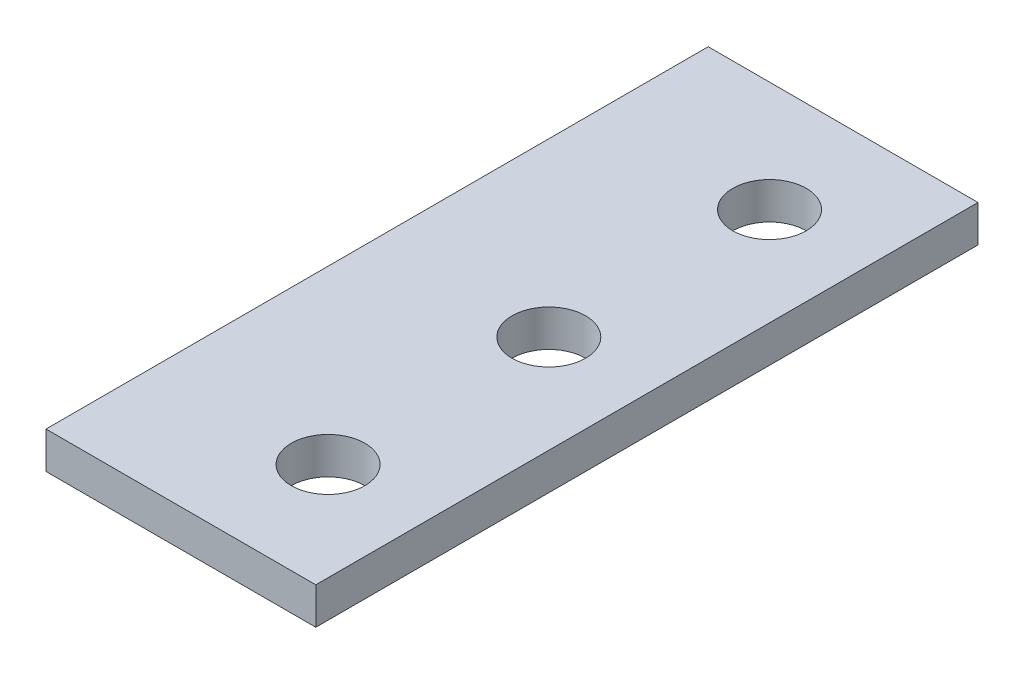
ISO-10303-21;
HEADER;
FILE_DESCRIPTION(('STEP AP214'),'2;1');
FILE_NAME('part.step','',(''),(''),'','','');
FILE_SCHEMA(('AUTOMOTIVE_DESIGN { 1 0 10303 214 1 1 1 1 }'));
ENDSEC;
DATA;
#1=APPLICATION_CONTEXT('core data for automotive mechanical design processes');
#2=APPLICATION_PROTOCOL_DEFINITION('international standard','automotive_design',2000,#1);
#3=PRODUCT_CONTEXT('',#1,'mechanical');
#4=PRODUCT('Part','Part','',(#3));
#5=PRODUCT_RELATED_PRODUCT_CATEGORY('part','',(#4));
#6=PRODUCT_DEFINITION_FORMATION('','',#4);
#7=PRODUCT_DEFINITION_CONTEXT('part definition',#1,'design');
#8=PRODUCT_DEFINITION('design','',#6,#7);
#9=PRODUCT_DEFINITION_SHAPE('','',#8);
#10=(LENGTH_UNIT() NAMED_UNIT(*) SI_UNIT(.MILLI.,.METRE.));
#11=(NAMED_UNIT(*) PLANE_ANGLE_UNIT() SI_UNIT($,.RADIAN.));
#12=(NAMED_UNIT(*) SI_UNIT($,.STERADIAN.) SOLID_ANGLE_UNIT());
#13=UNCERTAINTY_MEASURE_WITH_UNIT(LENGTH_MEASURE(1.E-05),#10,'distance_accuracy_value','');
#14=(GEOMETRIC_REPRESENTATION_CONTEXT(3) GLOBAL_UNCERTAINTY_ASSIGNED_CONTEXT((#13)) GLOBAL_UNIT_ASSIGNED_CONTEXT((#10,
#11,#12)) REPRESENTATION_CONTEXT('',''));
#15=CARTESIAN_POINT('',(0.,0.,0.));
#16=DIRECTION('',(0.,0.,1.));
#17=DIRECTION('',(1.,0.,0.));
#18=AXIS2_PLACEMENT_3D('',#15,#16,#17);
#19=CARTESIAN_POINT('',(0.,9.,0.));
#20=DIRECTION('',(0.,1.,0.));
#21=DIRECTION('',(0.,0.,1.));
#22=AXIS2_PLACEMENT_3D('',#19,#20,#21);
#23=PLANE('',#22);
#24=CARTESIAN_POINT('',(10.4821420896549,9.,-16.5566037735849));
#25=DIRECTION('',(0.,1.,0.));
#26=DIRECTION('',(0.,0.,1.));
#27=AXIS2_PLACEMENT_3D('',#24,#25,#26);
#28=CIRCLE('',#27,9.);
#29=CARTESIAN_POINT('',(10.4821420896549,9.,-7.55660377358494));
#30=VERTEX_POINT('',#29);
#31=EDGE_CURVE('E140',#30,#30,#28,.T.);
#32=ORIENTED_EDGE('',*,*,#31,.F.);
#33=EDGE_LOOP('',(#32));
#34=FACE_BOUND('',#33,.T.);
#35=DIRECTION('',(0.,0.,1.));
#36=VECTOR('',#35,1.);
#37=CARTESIAN_POINT('',(-31.5178579103451,9.,-97.556603773585));
#38=LINE('',#37,#36);
#39=CARTESIAN_POINT('',(-31.5178579103451,9.,-97.556603773585));
#40=VERTEX_POINT('',#39);
#41=CARTESIAN_POINT('',(-31.5178579103451,9.,64.443396226415));
#42=VERTEX_POINT('',#41);
#43=EDGE_CURVE('E97',#40,#42,#38,.T.);
#44=ORIENTED_EDGE('',*,*,#43,.T.);
#45=DIRECTION('',(1.,0.,0.));
#46=VECTOR('',#45,1.);
#47=CARTESIAN_POINT('',(-31.5178579103451,9.,64.443396226415));
#48=LINE('',#47,#46);
#49=CARTESIAN_POINT('',(34.4821420896549,9.,64.443396226415));
#50=VERTEX_POINT('',#49);
#51=EDGE_CURVE('E92',#42,#50,#48,.T.);
#52=ORIENTED_EDGE('',*,*,#51,.T.);
#53=DIRECTION('',(0.,0.,-1.));
#54=VECTOR('',#53,1.);
#55=CARTESIAN_POINT('',(34.4821420896549,9.,40.4433962264151));
#56=LINE('',#55,#54);
#57=CARTESIAN_POINT('',(34.4821420896549,9.,-97.556603773585));
#58=VERTEX_POINT('',#57);
#59=EDGE_CURVE('E95',#50,#58,#56,.T.);
#60=ORIENTED_EDGE('',*,*,#59,.T.);
#61=DIRECTION('',(-1.,0.,0.));
#62=VECTOR('',#61,1.);
#63=CARTESIAN_POINT('',(-31.5178579103451,9.,-97.556603773585));
#64=LINE('',#63,#62);
#65=EDGE_CURVE('E63',#58,#40,#64,.T.);
#66=ORIENTED_EDGE('',*,*,#65,.T.);
#67=EDGE_LOOP('',(#44,#52,#60,#66));
#68=FACE_BOUND('',#67,.T.);
#69=CARTESIAN_POINT('',(10.4821420896549,9.,37.4433962264151));
#70=DIRECTION('',(0.,1.,0.));
#71=DIRECTION('',(0.,0.,1.));
#72=AXIS2_PLACEMENT_3D('',#69,#70,#71);
#73=CIRCLE('',#72,9.);
#74=CARTESIAN_POINT('',(10.4821420896549,9.,46.4433962264151));
#75=VERTEX_POINT('',#74);
#76=EDGE_CURVE('E118',#75,#75,#73,.T.);
#77=ORIENTED_EDGE('',*,*,#76,.F.);
#78=EDGE_LOOP('',(#77));
#79=FACE_BOUND('',#78,.T.);
#80=CARTESIAN_POINT('',(10.4821420896549,9.,-70.5566037735849));
#81=DIRECTION('',(0.,1.,0.));
#82=DIRECTION('',(0.,0.,1.));
#83=AXIS2_PLACEMENT_3D('',#80,#81,#82);
#84=CIRCLE('',#83,9.);
#85=CARTESIAN_POINT('',(10.4821420896549,9.,-61.5566037735849));
#86=VERTEX_POINT('',#85);
#87=EDGE_CURVE('E148',#86,#86,#84,.T.);
#88=ORIENTED_EDGE('',*,*,#87,.F.);
#89=EDGE_LOOP('',(#88));
#90=FACE_BOUND('',#89,.T.);
#91=ADVANCED_FACE('F45',(#34,#68,#79,#90),#23,.T.);
#92=CARTESIAN_POINT('',(0.,0.,0.));
#93=DIRECTION('',(0.,1.,0.));
#94=DIRECTION('',(0.,0.,1.));
#95=AXIS2_PLACEMENT_3D('',#92,#93,#94);
#96=PLANE('',#95);
#97=DIRECTION('',(0.,0.,1.));
#98=VECTOR('',#97,1.);
#99=CARTESIAN_POINT('',(-31.5178579103451,0.,-97.556603773585));
#100=LINE('',#99,#98);
#101=CARTESIAN_POINT('',(-31.5178579103451,0.,-97.556603773585));
#102=VERTEX_POINT('',#101);
#103=CARTESIAN_POINT('',(-31.5178579103451,0.,64.443396226415));
#104=VERTEX_POINT('',#103);
#105=EDGE_CURVE('E114',#102,#104,#100,.T.);
#106=ORIENTED_EDGE('',*,*,#105,.F.);
#107=DIRECTION('',(-1.,0.,0.));
#108=VECTOR('',#107,1.);
#109=CARTESIAN_POINT('',(-31.5178579103451,0.,-97.556603773585));
#110=LINE('',#109,#108);
#111=CARTESIAN_POINT('',(34.4821420896549,0.,-97.556603773585));
#112=VERTEX_POINT('',#111);
#113=EDGE_CURVE('E85',#112,#102,#110,.T.);
#114=ORIENTED_EDGE('',*,*,#113,.F.);
#115=DIRECTION('',(0.,0.,-1.));
#116=VECTOR('',#115,1.);
#117=CARTESIAN_POINT('',(34.4821420896549,0.,-97.556603773585));
#118=LINE('',#117,#116);
#119=CARTESIAN_POINT('',(34.4821420896549,0.,64.443396226415));
#120=VERTEX_POINT('',#119);
#121=EDGE_CURVE('E79',#120,#112,#118,.T.);
#122=ORIENTED_EDGE('',*,*,#121,.F.);
#123=DIRECTION('',(1.,0.,0.));
#124=VECTOR('',#123,1.);
#125=CARTESIAN_POINT('',(10.4821420896549,0.,64.443396226415));
#126=LINE('',#125,#124);
#127=EDGE_CURVE('E103',#104,#120,#126,.T.);
#128=ORIENTED_EDGE('',*,*,#127,.F.);
#129=EDGE_LOOP('',(#106,#114,#122,#128));
#130=FACE_BOUND('',#129,.T.);
#131=CARTESIAN_POINT('',(10.4821420896549,0.,37.4433962264151));
#132=DIRECTION('',(0.,1.,0.));
#133=DIRECTION('',(0.,0.,1.));
#134=AXIS2_PLACEMENT_3D('',#131,#132,#133);
#135=CIRCLE('',#134,9.);
#136=CARTESIAN_POINT('',(10.4821420896549,0.,46.4433962264151));
#137=VERTEX_POINT('',#136);
#138=EDGE_CURVE('E136',#137,#137,#135,.T.);
#139=ORIENTED_EDGE('',*,*,#138,.T.);
#140=EDGE_LOOP('',(#139));
#141=FACE_BOUND('',#140,.T.);
#142=CARTESIAN_POINT('',(10.4821420896549,0.,-16.5566037735849));
#143=DIRECTION('',(0.,1.,0.));
#144=DIRECTION('',(0.,0.,1.));
#145=AXIS2_PLACEMENT_3D('',#142,#143,#144);
#146=CIRCLE('',#145,9.);
#147=CARTESIAN_POINT('',(10.4821420896549,0.,-7.55660377358494));
#148=VERTEX_POINT('',#147);
#149=EDGE_CURVE('E144',#148,#148,#146,.T.);
#150=ORIENTED_EDGE('',*,*,#149,.T.);
#151=EDGE_LOOP('',(#150));
#152=FACE_BOUND('',#151,.T.);
#153=CARTESIAN_POINT('',(10.4821420896549,0.,-70.5566037735849));
#154=DIRECTION('',(0.,1.,0.));
#155=DIRECTION('',(0.,0.,1.));
#156=AXIS2_PLACEMENT_3D('',#153,#154,#155);
#157=CIRCLE('',#156,9.);
#158=CARTESIAN_POINT('',(10.4821420896549,0.,-61.5566037735849));
#159=VERTEX_POINT('',#158);
#160=EDGE_CURVE('E152',#159,#159,#157,.T.);
#161=ORIENTED_EDGE('',*,*,#160,.T.);
#162=EDGE_LOOP('',(#161));
#163=FACE_BOUND('',#162,.T.);
#164=ADVANCED_FACE('F131',(#130,#141,#152,#163),#96,.F.);
#165=CARTESIAN_POINT('',(-31.5178579103451,9.,-97.556603773585));
#166=DIRECTION('',(1.,0.,0.));
#167=DIRECTION('',(0.,0.,-1.));
#168=AXIS2_PLACEMENT_3D('',#165,#166,#167);
#169=PLANE('',#168);
#170=ORIENTED_EDGE('',*,*,#105,.T.);
#171=DIRECTION('',(0.,-1.,0.));
#172=VECTOR('',#171,1.);
#173=CARTESIAN_POINT('',(-31.5178579103451,9.,64.443396226415));
#174=LINE('',#173,#172);
#175=EDGE_CURVE('E11',#42,#104,#174,.T.);
#176=ORIENTED_EDGE('',*,*,#175,.F.);
#177=ORIENTED_EDGE('',*,*,#43,.F.);
#178=DIRECTION('',(0.,-1.,0.));
#179=VECTOR('',#178,1.);
#180=CARTESIAN_POINT('',(-31.5178579103451,9.,-97.556603773585));
#181=LINE('',#180,#179);
#182=EDGE_CURVE('E110',#40,#102,#181,.T.);
#183=ORIENTED_EDGE('',*,*,#182,.T.);
#184=EDGE_LOOP('',(#170,#176,#177,#183));
#185=FACE_BOUND('',#184,.T.);
#186=ADVANCED_FACE('F47',(#185),#169,.F.);
#187=CARTESIAN_POINT('',(10.4821420896549,9.,64.443396226415));
#188=DIRECTION('',(0.,0.,-1.));
#189=DIRECTION('',(-1.,0.,0.));
#190=AXIS2_PLACEMENT_3D('',#187,#188,#189);
#191=PLANE('',#190);
#192=ORIENTED_EDGE('',*,*,#127,.T.);
#193=DIRECTION('',(0.,-1.,0.));
#194=VECTOR('',#193,1.);
#195=CARTESIAN_POINT('',(34.4821420896549,9.,64.443396226415));
#196=LINE('',#195,#194);
#197=EDGE_CURVE('E55',#50,#120,#196,.T.);
#198=ORIENTED_EDGE('',*,*,#197,.F.);
#199=ORIENTED_EDGE('',*,*,#51,.F.);
#200=ORIENTED_EDGE('',*,*,#175,.T.);
#201=EDGE_LOOP('',(#192,#198,#199,#200));
#202=FACE_BOUND('',#201,.T.);
#203=ADVANCED_FACE('F102',(#202),#191,.F.);
#204=CARTESIAN_POINT('',(34.4821420896549,9.,-97.556603773585));
#205=DIRECTION('',(-1.,0.,0.));
#206=DIRECTION('',(0.,0.,1.));
#207=AXIS2_PLACEMENT_3D('',#204,#205,#206);
#208=PLANE('',#207);
#209=ORIENTED_EDGE('',*,*,#121,.T.);
#210=DIRECTION('',(0.,-1.,0.));
#211=VECTOR('',#210,1.);
#212=CARTESIAN_POINT('',(34.4821420896549,9.,-97.556603773585));
#213=LINE('',#212,#211);
#214=EDGE_CURVE('E105',#58,#112,#213,.T.);
#215=ORIENTED_EDGE('',*,*,#214,.F.);
#216=ORIENTED_EDGE('',*,*,#59,.F.);
#217=ORIENTED_EDGE('',*,*,#197,.T.);
#218=EDGE_LOOP('',(#209,#215,#216,#217));
#219=FACE_BOUND('',#218,.T.);
#220=ADVANCED_FACE('F106',(#219),#208,.F.);
#221=CARTESIAN_POINT('',(-31.5178579103451,9.,-97.556603773585));
#222=DIRECTION('',(0.,0.,1.));
#223=DIRECTION('',(1.,0.,0.));
#224=AXIS2_PLACEMENT_3D('',#221,#222,#223);
#225=PLANE('',#224);
#226=ORIENTED_EDGE('',*,*,#113,.T.);
#227=ORIENTED_EDGE('',*,*,#182,.F.);
#228=ORIENTED_EDGE('',*,*,#65,.F.);
#229=ORIENTED_EDGE('',*,*,#214,.T.);
#230=EDGE_LOOP('',(#226,#227,#228,#229));
#231=FACE_BOUND('',#230,.T.);
#232=ADVANCED_FACE('F128',(#231),#225,.F.);
#233=CARTESIAN_POINT('',(10.4821420896549,9.,37.4433962264151));
#234=DIRECTION('',(0.,-1.,0.));
#235=DIRECTION('',(0.,0.,-1.));
#236=AXIS2_PLACEMENT_3D('',#233,#234,#235);
#237=CYLINDRICAL_SURFACE('',#236,9.);
#238=ORIENTED_EDGE('',*,*,#76,.T.);
#239=EDGE_LOOP('',(#238));
#240=FACE_BOUND('',#239,.T.);
#241=ORIENTED_EDGE('',*,*,#138,.F.);
#242=EDGE_LOOP('',(#241));
#243=FACE_BOUND('',#242,.T.);
#244=ADVANCED_FACE('F172',(#240,#243),#237,.F.);
#245=CARTESIAN_POINT('',(10.4821420896549,9.,-16.5566037735849));
#246=DIRECTION('',(0.,-1.,0.));
#247=DIRECTION('',(0.,0.,-1.));
#248=AXIS2_PLACEMENT_3D('',#245,#246,#247);
#249=CYLINDRICAL_SURFACE('',#248,9.);
#250=ORIENTED_EDGE('',*,*,#31,.T.);
#251=EDGE_LOOP('',(#250));
#252=FACE_BOUND('',#251,.T.);
#253=ORIENTED_EDGE('',*,*,#149,.F.);
#254=EDGE_LOOP('',(#253));
#255=FACE_BOUND('',#254,.T.);
#256=ADVANCED_FACE('F209',(#252,#255),#249,.F.);
#257=CARTESIAN_POINT('',(10.4821420896549,9.,-70.5566037735849));
#258=DIRECTION('',(0.,-1.,0.));
#259=DIRECTION('',(0.,0.,-1.));
#260=AXIS2_PLACEMENT_3D('',#257,#258,#259);
#261=CYLINDRICAL_SURFACE('',#260,9.);
#262=ORIENTED_EDGE('',*,*,#87,.T.);
#263=EDGE_LOOP('',(#262));
#264=FACE_BOUND('',#263,.T.);
#265=ORIENTED_EDGE('',*,*,#160,.F.);
#266=EDGE_LOOP('',(#265));
#267=FACE_BOUND('',#266,.T.);
#268=ADVANCED_FACE('F160',(#264,#267),#261,.F.);
#269=CLOSED_SHELL('',(#91,#164,#186,#203,#220,#232,#244,#256,#268));
#270=MANIFOLD_SOLID_BREP('B2',#269);
#271=ADVANCED_BREP_SHAPE_REPRESENTATION('',(#18,#270),#14);
#272=SHAPE_DEFINITION_REPRESENTATION(#9,#271);
ENDSEC;
END-ISO-10303-21;
